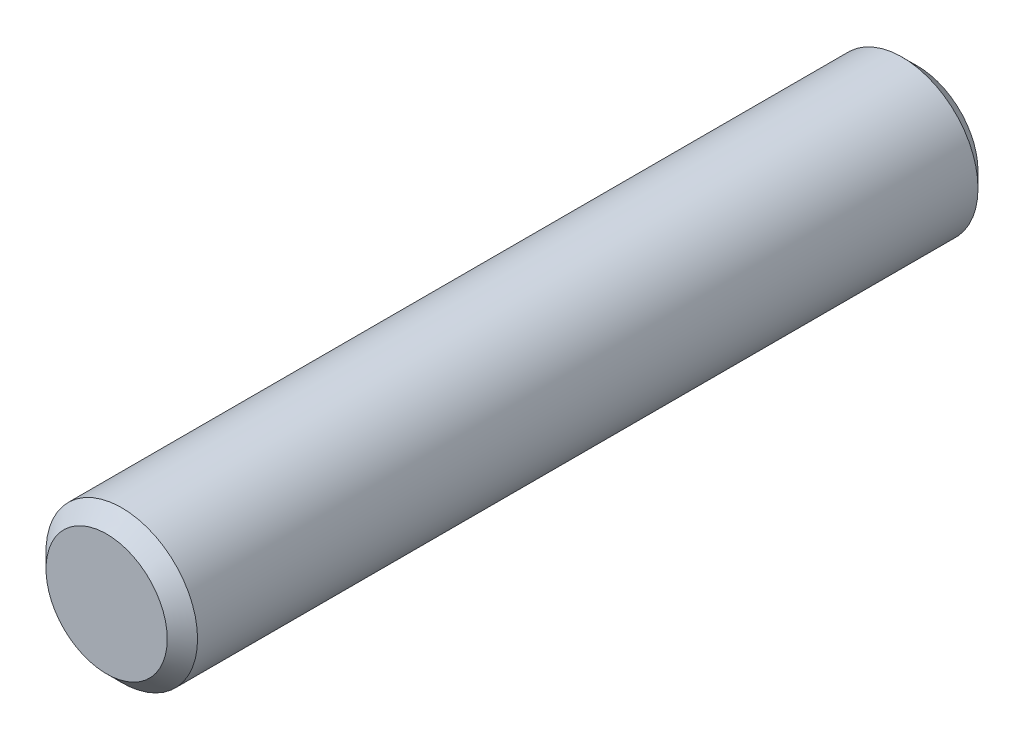
ISO-10303-21;
HEADER;
FILE_DESCRIPTION(('STEP AP214'),'2;1');
FILE_NAME('part.step','',(''),(''),'','','');
FILE_SCHEMA(('AUTOMOTIVE_DESIGN { 1 0 10303 214 1 1 1 1 }'));
ENDSEC;
DATA;
#1=APPLICATION_CONTEXT('core data for automotive mechanical design processes');
#2=APPLICATION_PROTOCOL_DEFINITION('international standard','automotive_design',2000,#1);
#3=PRODUCT_CONTEXT('',#1,'mechanical');
#4=PRODUCT('Part','Part','',(#3));
#5=PRODUCT_RELATED_PRODUCT_CATEGORY('part','',(#4));
#6=PRODUCT_DEFINITION_FORMATION('','',#4);
#7=PRODUCT_DEFINITION_CONTEXT('part definition',#1,'design');
#8=PRODUCT_DEFINITION('design','',#6,#7);
#9=PRODUCT_DEFINITION_SHAPE('','',#8);
#10=(LENGTH_UNIT() NAMED_UNIT(*) SI_UNIT(.MILLI.,.METRE.));
#11=(NAMED_UNIT(*) PLANE_ANGLE_UNIT() SI_UNIT($,.RADIAN.));
#12=(NAMED_UNIT(*) SI_UNIT($,.STERADIAN.) SOLID_ANGLE_UNIT());
#13=UNCERTAINTY_MEASURE_WITH_UNIT(LENGTH_MEASURE(1.E-05),#10,'distance_accuracy_value','');
#14=(GEOMETRIC_REPRESENTATION_CONTEXT(3) GLOBAL_UNCERTAINTY_ASSIGNED_CONTEXT((#13)) GLOBAL_UNIT_ASSIGNED_CONTEXT((#10,
#11,#12)) REPRESENTATION_CONTEXT('',''));
#15=CARTESIAN_POINT('',(0.,0.,0.));
#16=DIRECTION('',(0.,0.,1.));
#17=DIRECTION('',(1.,0.,0.));
#18=AXIS2_PLACEMENT_3D('',#15,#16,#17);
#19=CARTESIAN_POINT('',(0.,0.,42.4625));
#20=DIRECTION('',(0.,0.,-1.));
#21=DIRECTION('',(-1.,0.,0.));
#22=AXIS2_PLACEMENT_3D('',#19,#20,#21);
#23=CYLINDRICAL_SURFACE('',#22,7.9375);
#24=CARTESIAN_POINT('',(0.,0.,-40.8749999999999));
#25=DIRECTION('',(0.,0.,1.));
#26=DIRECTION('',(1.,0.,0.));
#27=AXIS2_PLACEMENT_3D('',#24,#25,#26);
#28=CIRCLE('',#27,7.9375);
#29=CARTESIAN_POINT('',(7.9375,0.,-40.8749999999999));
#30=VERTEX_POINT('',#29);
#31=EDGE_CURVE('E52',#30,#30,#28,.T.);
#32=ORIENTED_EDGE('',*,*,#31,.T.);
#33=EDGE_LOOP('',(#32));
#34=FACE_BOUND('',#33,.T.);
#35=CARTESIAN_POINT('',(0.,0.,40.875));
#36=DIRECTION('',(0.,0.,1.));
#37=DIRECTION('',(1.,0.,0.));
#38=AXIS2_PLACEMENT_3D('',#35,#36,#37);
#39=CIRCLE('',#38,7.9375);
#40=CARTESIAN_POINT('',(7.9375,0.,40.875));
#41=VERTEX_POINT('',#40);
#42=EDGE_CURVE('E56',#41,#41,#39,.F.);
#43=ORIENTED_EDGE('',*,*,#42,.T.);
#44=EDGE_LOOP('',(#43));
#45=FACE_BOUND('',#44,.T.);
#46=ADVANCED_FACE('F41',(#34,#45),#23,.T.);
#47=CARTESIAN_POINT('',(0.,0.,42.4625));
#48=DIRECTION('',(0.,0.,1.));
#49=DIRECTION('',(1.,0.,0.));
#50=AXIS2_PLACEMENT_3D('',#47,#48,#49);
#51=PLANE('',#50);
#52=CARTESIAN_POINT('',(0.,0.,42.4625));
#53=DIRECTION('',(0.,0.,1.));
#54=DIRECTION('',(1.,0.,0.));
#55=AXIS2_PLACEMENT_3D('',#52,#53,#54);
#56=CIRCLE('',#55,6.35000000000003);
#57=CARTESIAN_POINT('',(6.35000000000003,0.,42.4625));
#58=VERTEX_POINT('',#57);
#59=EDGE_CURVE('E10',#58,#58,#56,.T.);
#60=ORIENTED_EDGE('',*,*,#59,.T.);
#61=EDGE_LOOP('',(#60));
#62=FACE_BOUND('',#61,.T.);
#63=ADVANCED_FACE('F72',(#62),#51,.T.);
#64=CARTESIAN_POINT('',(0.,0.,-42.4625));
#65=DIRECTION('',(0.,0.,1.));
#66=DIRECTION('',(1.,0.,0.));
#67=AXIS2_PLACEMENT_3D('',#64,#65,#66);
#68=PLANE('',#67);
#69=CARTESIAN_POINT('',(0.,0.,-42.4625));
#70=DIRECTION('',(0.,0.,1.));
#71=DIRECTION('',(1.,0.,0.));
#72=AXIS2_PLACEMENT_3D('',#69,#70,#71);
#73=CIRCLE('',#72,6.3499999999999);
#74=CARTESIAN_POINT('',(6.3499999999999,0.,-42.4625));
#75=VERTEX_POINT('',#74);
#76=EDGE_CURVE('E48',#75,#75,#73,.F.);
#77=ORIENTED_EDGE('',*,*,#76,.T.);
#78=EDGE_LOOP('',(#77));
#79=FACE_BOUND('',#78,.T.);
#80=ADVANCED_FACE('F69',(#79),#68,.F.);
#81=CARTESIAN_POINT('',(0.,0.,-40.8749999999999));
#82=DIRECTION('',(0.,0.,1.));
#83=DIRECTION('',(1.,0.,0.));
#84=AXIS2_PLACEMENT_3D('',#81,#82,#83);
#85=CONICAL_SURFACE('',#84,7.9375,0.78539816339745);
#86=ORIENTED_EDGE('',*,*,#76,.F.);
#87=EDGE_LOOP('',(#86));
#88=FACE_BOUND('',#87,.T.);
#89=ORIENTED_EDGE('',*,*,#31,.F.);
#90=EDGE_LOOP('',(#89));
#91=FACE_BOUND('',#90,.T.);
#92=ADVANCED_FACE('F65',(#88,#91),#85,.T.);
#93=CARTESIAN_POINT('',(0.,0.,42.4625));
#94=DIRECTION('',(0.,0.,-1.));
#95=DIRECTION('',(-1.,0.,0.));
#96=AXIS2_PLACEMENT_3D('',#93,#94,#95);
#97=CONICAL_SURFACE('',#96,6.35000000000003,0.785398163397445);
#98=ORIENTED_EDGE('',*,*,#42,.F.);
#99=EDGE_LOOP('',(#98));
#100=FACE_BOUND('',#99,.T.);
#101=ORIENTED_EDGE('',*,*,#59,.F.);
#102=EDGE_LOOP('',(#101));
#103=FACE_BOUND('',#102,.T.);
#104=ADVANCED_FACE('F43',(#100,#103),#97,.T.);
#105=CLOSED_SHELL('',(#46,#63,#80,#92,#104));
#106=MANIFOLD_SOLID_BREP('B2',#105);
#107=ADVANCED_BREP_SHAPE_REPRESENTATION('',(#18,#106),#14);
#108=SHAPE_DEFINITION_REPRESENTATION(#9,#107);
ENDSEC;
END-ISO-10303-21;
